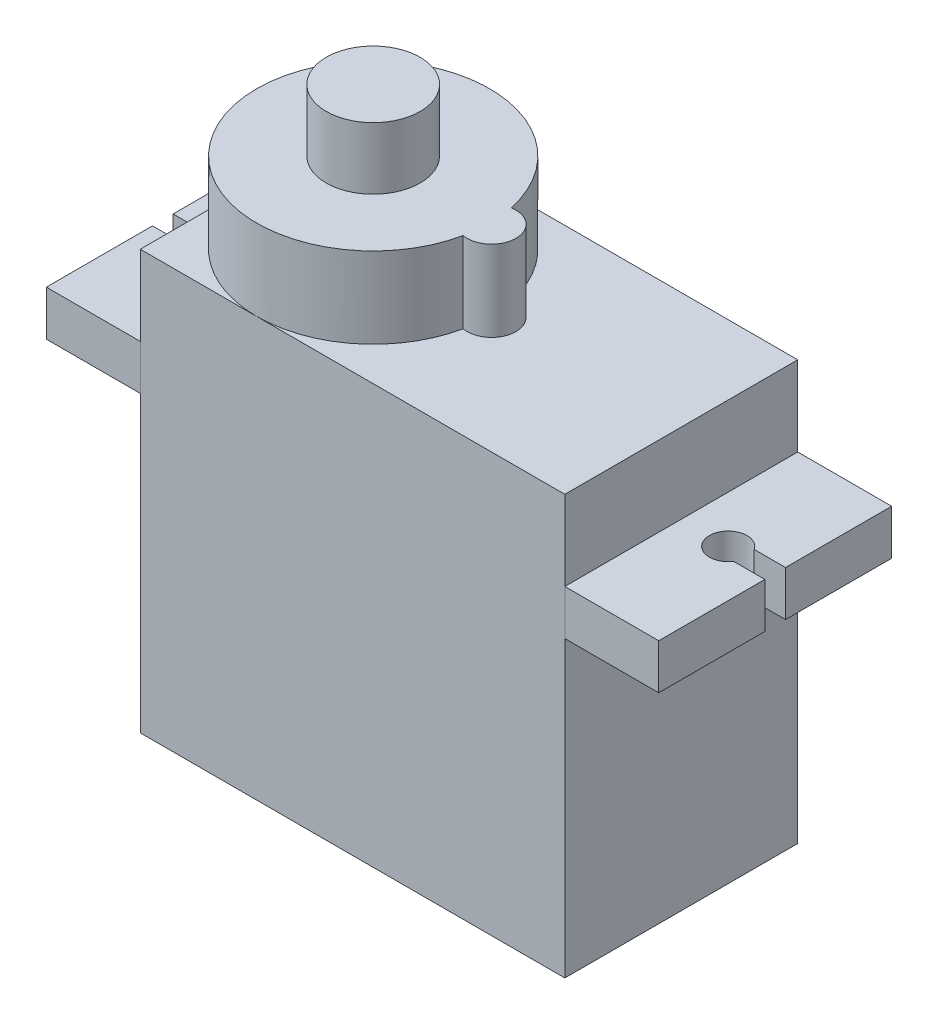
ISO-10303-21;
HEADER;
FILE_DESCRIPTION(('STEP AP214'),'2;1');
FILE_NAME('part.step','',(''),(''),'','','');
FILE_SCHEMA(('AUTOMOTIVE_DESIGN { 1 0 10303 214 1 1 1 1 }'));
ENDSEC;
DATA;
#1=APPLICATION_CONTEXT('core data for automotive mechanical design processes');
#2=APPLICATION_PROTOCOL_DEFINITION('international standard','automotive_design',2000,#1);
#3=PRODUCT_CONTEXT('',#1,'mechanical');
#4=PRODUCT('Part','Part','',(#3));
#5=PRODUCT_RELATED_PRODUCT_CATEGORY('part','',(#4));
#6=PRODUCT_DEFINITION_FORMATION('','',#4);
#7=PRODUCT_DEFINITION_CONTEXT('part definition',#1,'design');
#8=PRODUCT_DEFINITION('design','',#6,#7);
#9=PRODUCT_DEFINITION_SHAPE('','',#8);
#10=(LENGTH_UNIT() NAMED_UNIT(*) SI_UNIT(.MILLI.,.METRE.));
#11=(NAMED_UNIT(*) PLANE_ANGLE_UNIT() SI_UNIT($,.RADIAN.));
#12=(NAMED_UNIT(*) SI_UNIT($,.STERADIAN.) SOLID_ANGLE_UNIT());
#13=UNCERTAINTY_MEASURE_WITH_UNIT(LENGTH_MEASURE(1.E-05),#10,'distance_accuracy_value','');
#14=(GEOMETRIC_REPRESENTATION_CONTEXT(3) GLOBAL_UNCERTAINTY_ASSIGNED_CONTEXT((#13)) GLOBAL_UNIT_ASSIGNED_CONTEXT((#10,
#11,#12)) REPRESENTATION_CONTEXT('',''));
#15=CARTESIAN_POINT('',(0.,0.,0.));
#16=DIRECTION('',(0.,0.,1.));
#17=DIRECTION('',(1.,0.,0.));
#18=AXIS2_PLACEMENT_3D('',#15,#16,#17);
#19=CARTESIAN_POINT('',(-13.6,4.5,1.2));
#20=DIRECTION('',(1.,0.,0.));
#21=DIRECTION('',(0.,0.,-1.));
#22=AXIS2_PLACEMENT_3D('',#19,#20,#21);
#23=CYLINDRICAL_SURFACE('',#22,0.6);
#24=CARTESIAN_POINT('',(-13.6,4.5,1.2));
#25=DIRECTION('',(-1.,0.,0.));
#26=DIRECTION('',(0.,0.,1.));
#27=AXIS2_PLACEMENT_3D('',#24,#25,#26);
#28=CIRCLE('',#27,0.6);
#29=CARTESIAN_POINT('',(-13.6,4.5,1.8));
#30=VERTEX_POINT('',#29);
#31=EDGE_CURVE('E12',#30,#30,#28,.T.);
#32=ORIENTED_EDGE('',*,*,#31,.F.);
#33=EDGE_LOOP('',(#32));
#34=FACE_BOUND('',#33,.T.);
#35=CARTESIAN_POINT('',(-11.3,4.5,1.2));
#36=DIRECTION('',(-1.,0.,0.));
#37=DIRECTION('',(0.,0.,1.));
#38=AXIS2_PLACEMENT_3D('',#35,#36,#37);
#39=CIRCLE('',#38,0.6);
#40=CARTESIAN_POINT('',(-11.3,4.5,1.8));
#41=VERTEX_POINT('',#40);
#42=EDGE_CURVE('E52',#41,#41,#39,.T.);
#43=ORIENTED_EDGE('',*,*,#42,.T.);
#44=EDGE_LOOP('',(#43));
#45=FACE_BOUND('',#44,.T.);
#46=ADVANCED_FACE('F49',(#34,#45),#23,.T.);
#47=CARTESIAN_POINT('',(-13.6,0.,0.));
#48=DIRECTION('',(-1.,0.,0.));
#49=DIRECTION('',(0.,0.,1.));
#50=AXIS2_PLACEMENT_3D('',#47,#48,#49);
#51=PLANE('',#50);
#52=ORIENTED_EDGE('',*,*,#31,.T.);
#53=EDGE_LOOP('',(#52));
#54=FACE_BOUND('',#53,.T.);
#55=ADVANCED_FACE('F64',(#54),#51,.T.);
#56=CARTESIAN_POINT('',(-11.3,0.,0.));
#57=DIRECTION('',(-1.,0.,0.));
#58=DIRECTION('',(0.,0.,1.));
#59=AXIS2_PLACEMENT_3D('',#56,#57,#58);
#60=PLANE('',#59);
#61=ORIENTED_EDGE('',*,*,#42,.F.);
#62=EDGE_LOOP('',(#61));
#63=FACE_BOUND('',#62,.T.);
#64=ADVANCED_FACE('F62',(#63),#60,.F.);
#65=CLOSED_SHELL('',(#46,#55,#64));
#66=MANIFOLD_SOLID_BREP('B2',#65);
#67=CARTESIAN_POINT('',(-13.6,4.5,-1.2));
#68=DIRECTION('',(1.,0.,0.));
#69=DIRECTION('',(0.,0.,-1.));
#70=AXIS2_PLACEMENT_3D('',#67,#68,#69);
#71=CYLINDRICAL_SURFACE('',#70,0.6);
#72=CARTESIAN_POINT('',(-13.6,4.5,-1.2));
#73=DIRECTION('',(-1.,0.,0.));
#74=DIRECTION('',(0.,0.,1.));
#75=AXIS2_PLACEMENT_3D('',#72,#73,#74);
#76=CIRCLE('',#75,0.6);
#77=CARTESIAN_POINT('',(-13.6,4.5,-0.600000000000001));
#78=VERTEX_POINT('',#77);
#79=EDGE_CURVE('E48',#78,#78,#76,.T.);
#80=ORIENTED_EDGE('',*,*,#79,.F.);
#81=EDGE_LOOP('',(#80));
#82=FACE_BOUND('',#81,.T.);
#83=CARTESIAN_POINT('',(-11.3,4.5,-1.2));
#84=DIRECTION('',(-1.,0.,0.));
#85=DIRECTION('',(0.,0.,1.));
#86=AXIS2_PLACEMENT_3D('',#83,#84,#85);
#87=CIRCLE('',#86,0.6);
#88=CARTESIAN_POINT('',(-11.3,4.5,-0.600000000000001));
#89=VERTEX_POINT('',#88);
#90=EDGE_CURVE('E104',#89,#89,#87,.T.);
#91=ORIENTED_EDGE('',*,*,#90,.T.);
#92=EDGE_LOOP('',(#91));
#93=FACE_BOUND('',#92,.T.);
#94=ADVANCED_FACE('F101',(#82,#93),#71,.T.);
#95=CARTESIAN_POINT('',(-13.6,0.,0.));
#96=DIRECTION('',(-1.,0.,0.));
#97=DIRECTION('',(0.,0.,1.));
#98=AXIS2_PLACEMENT_3D('',#95,#96,#97);
#99=PLANE('',#98);
#100=ORIENTED_EDGE('',*,*,#79,.T.);
#101=EDGE_LOOP('',(#100));
#102=FACE_BOUND('',#101,.T.);
#103=ADVANCED_FACE('F116',(#102),#99,.T.);
#104=CARTESIAN_POINT('',(-11.3,0.,0.));
#105=DIRECTION('',(-1.,0.,0.));
#106=DIRECTION('',(0.,0.,1.));
#107=AXIS2_PLACEMENT_3D('',#104,#105,#106);
#108=PLANE('',#107);
#109=ORIENTED_EDGE('',*,*,#90,.F.);
#110=EDGE_LOOP('',(#109));
#111=FACE_BOUND('',#110,.T.);
#112=ADVANCED_FACE('F114',(#111),#108,.F.);
#113=CLOSED_SHELL('',(#94,#103,#112));
#114=MANIFOLD_SOLID_BREP('B7',#113);
#115=CARTESIAN_POINT('',(-13.6,4.5,0.));
#116=DIRECTION('',(1.,0.,0.));
#117=DIRECTION('',(0.,0.,-1.));
#118=AXIS2_PLACEMENT_3D('',#115,#116,#117);
#119=CYLINDRICAL_SURFACE('',#118,0.6);
#120=CARTESIAN_POINT('',(-13.6,4.5,0.));
#121=DIRECTION('',(-1.,0.,0.));
#122=DIRECTION('',(0.,0.,1.));
#123=AXIS2_PLACEMENT_3D('',#120,#121,#122);
#124=CIRCLE('',#123,0.6);
#125=CARTESIAN_POINT('',(-13.6,4.5,0.599999999999999));
#126=VERTEX_POINT('',#125);
#127=EDGE_CURVE('E100',#126,#126,#124,.T.);
#128=ORIENTED_EDGE('',*,*,#127,.F.);
#129=EDGE_LOOP('',(#128));
#130=FACE_BOUND('',#129,.T.);
#131=CARTESIAN_POINT('',(-11.3,4.5,0.));
#132=DIRECTION('',(-1.,0.,0.));
#133=DIRECTION('',(0.,0.,1.));
#134=AXIS2_PLACEMENT_3D('',#131,#132,#133);
#135=CIRCLE('',#134,0.6);
#136=CARTESIAN_POINT('',(-11.3,4.5,0.599999999999999));
#137=VERTEX_POINT('',#136);
#138=EDGE_CURVE('E158',#137,#137,#135,.T.);
#139=ORIENTED_EDGE('',*,*,#138,.T.);
#140=EDGE_LOOP('',(#139));
#141=FACE_BOUND('',#140,.T.);
#142=ADVANCED_FACE('F155',(#130,#141),#119,.T.);
#143=CARTESIAN_POINT('',(-13.6,0.,0.));
#144=DIRECTION('',(-1.,0.,0.));
#145=DIRECTION('',(0.,0.,1.));
#146=AXIS2_PLACEMENT_3D('',#143,#144,#145);
#147=PLANE('',#146);
#148=ORIENTED_EDGE('',*,*,#127,.T.);
#149=EDGE_LOOP('',(#148));
#150=FACE_BOUND('',#149,.T.);
#151=ADVANCED_FACE('F170',(#150),#147,.T.);
#152=CARTESIAN_POINT('',(-11.3,0.,0.));
#153=DIRECTION('',(-1.,0.,0.));
#154=DIRECTION('',(0.,0.,1.));
#155=AXIS2_PLACEMENT_3D('',#152,#153,#154);
#156=PLANE('',#155);
#157=ORIENTED_EDGE('',*,*,#138,.F.);
#158=EDGE_LOOP('',(#157));
#159=FACE_BOUND('',#158,.T.);
#160=ADVANCED_FACE('F168',(#159),#156,.F.);
#161=CLOSED_SHELL('',(#142,#151,#160));
#162=MANIFOLD_SOLID_BREP('B43',#161);
#163=CARTESIAN_POINT('',(-16.3,0.,0.));
#164=DIRECTION('',(-1.,0.,0.));
#165=DIRECTION('',(0.,0.,1.));
#166=AXIS2_PLACEMENT_3D('',#163,#164,#165);
#167=PLANE('',#166);
#168=DIRECTION('',(0.,1.,0.));
#169=VECTOR('',#168,1.);
#170=CARTESIAN_POINT('',(-16.3,-0.001000000000001,-0.55));
#171=LINE('',#170,#169);
#172=CARTESIAN_POINT('',(-16.3,15.65,-0.55));
#173=VERTEX_POINT('',#172);
#174=CARTESIAN_POINT('',(-16.3,18.05,-0.55));
#175=VERTEX_POINT('',#174);
#176=EDGE_CURVE('E339',#173,#175,#171,.T.);
#177=ORIENTED_EDGE('',*,*,#176,.T.);
#178=DIRECTION('',(0.,0.,-1.));
#179=VECTOR('',#178,1.);
#180=CARTESIAN_POINT('',(-16.3,18.05,6.2));
#181=LINE('',#180,#179);
#182=CARTESIAN_POINT('',(-16.3,18.05,-6.2));
#183=VERTEX_POINT('',#182);
#184=EDGE_CURVE('E262',#175,#183,#181,.T.);
#185=ORIENTED_EDGE('',*,*,#184,.T.);
#186=DIRECTION('',(0.,-1.,0.));
#187=VECTOR('',#186,1.);
#188=CARTESIAN_POINT('',(-16.3,18.05,-6.2));
#189=LINE('',#188,#187);
#190=CARTESIAN_POINT('',(-16.3,15.65,-6.2));
#191=VERTEX_POINT('',#190);
#192=EDGE_CURVE('E301',#183,#191,#189,.T.);
#193=ORIENTED_EDGE('',*,*,#192,.T.);
#194=DIRECTION('',(0.,0.,1.));
#195=VECTOR('',#194,1.);
#196=CARTESIAN_POINT('',(-16.3,15.65,-6.2));
#197=LINE('',#196,#195);
#198=EDGE_CURVE('E307',#191,#173,#197,.T.);
#199=ORIENTED_EDGE('',*,*,#198,.T.);
#200=EDGE_LOOP('',(#177,#185,#193,#199));
#201=FACE_BOUND('',#200,.T.);
#202=ADVANCED_FACE('F209',(#201),#167,.T.);
#203=CARTESIAN_POINT('',(-16.3,18.05,6.2));
#204=DIRECTION('',(0.,-1.,0.));
#205=DIRECTION('',(0.,0.,-1.));
#206=AXIS2_PLACEMENT_3D('',#203,#204,#205);
#207=PLANE('',#206);
#208=ORIENTED_EDGE('',*,*,#184,.F.);
#209=DIRECTION('',(-1.,0.,0.));
#210=VECTOR('',#209,1.);
#211=CARTESIAN_POINT('',(-16.3,18.05,-0.55));
#212=LINE('',#211,#210);
#213=CARTESIAN_POINT('',(-14.6351646544245,18.05,-0.55));
#214=VERTEX_POINT('',#213);
#215=EDGE_CURVE('E290',#214,#175,#212,.T.);
#216=ORIENTED_EDGE('',*,*,#215,.F.);
#217=CARTESIAN_POINT('',(-13.8,18.05,0.));
#218=DIRECTION('',(0.,1.,0.));
#219=DIRECTION('',(0.,0.,1.));
#220=AXIS2_PLACEMENT_3D('',#217,#218,#219);
#221=CIRCLE('',#220,1.);
#222=CARTESIAN_POINT('',(-14.6351646544245,18.05,0.55));
#223=VERTEX_POINT('',#222);
#224=EDGE_CURVE('E297',#223,#214,#221,.T.);
#225=ORIENTED_EDGE('',*,*,#224,.F.);
#226=DIRECTION('',(1.,0.,0.));
#227=VECTOR('',#226,1.);
#228=CARTESIAN_POINT('',(-16.3,18.05,0.55));
#229=LINE('',#228,#227);
#230=CARTESIAN_POINT('',(-16.3,18.05,0.55));
#231=VERTEX_POINT('',#230);
#232=EDGE_CURVE('E286',#231,#223,#229,.T.);
#233=ORIENTED_EDGE('',*,*,#232,.F.);
#234=CARTESIAN_POINT('',(-16.3,18.05,6.2));
#235=VERTEX_POINT('',#234);
#236=EDGE_CURVE('E294',#235,#231,#181,.T.);
#237=ORIENTED_EDGE('',*,*,#236,.F.);
#238=DIRECTION('',(1.,0.,0.));
#239=VECTOR('',#238,1.);
#240=CARTESIAN_POINT('',(-16.3,18.05,6.2));
#241=LINE('',#240,#239);
#242=CARTESIAN_POINT('',(-11.3,18.05,6.2));
#243=VERTEX_POINT('',#242);
#244=EDGE_CURVE('E311',#235,#243,#241,.T.);
#245=ORIENTED_EDGE('',*,*,#244,.T.);
#246=DIRECTION('',(0.,0.,-1.));
#247=VECTOR('',#246,1.);
#248=CARTESIAN_POINT('',(-11.3,18.05,6.2));
#249=LINE('',#248,#247);
#250=CARTESIAN_POINT('',(-11.3,18.05,-6.2));
#251=VERTEX_POINT('',#250);
#252=EDGE_CURVE('E312',#243,#251,#249,.T.);
#253=ORIENTED_EDGE('',*,*,#252,.T.);
#254=DIRECTION('',(1.,0.,0.));
#255=VECTOR('',#254,1.);
#256=CARTESIAN_POINT('',(-16.3,18.05,-6.2));
#257=LINE('',#256,#255);
#258=EDGE_CURVE('E153',#183,#251,#257,.T.);
#259=ORIENTED_EDGE('',*,*,#258,.F.);
#260=EDGE_LOOP('',(#208,#216,#225,#233,#237,#245,#253,#259));
#261=FACE_BOUND('',#260,.T.);
#262=ADVANCED_FACE('F211',(#261),#207,.F.);
#263=CARTESIAN_POINT('',(-16.3,18.05,-6.2));
#264=DIRECTION('',(0.,0.,1.));
#265=DIRECTION('',(1.,0.,0.));
#266=AXIS2_PLACEMENT_3D('',#263,#264,#265);
#267=PLANE('',#266);
#268=DIRECTION('',(0.,-1.,0.));
#269=VECTOR('',#268,1.);
#270=CARTESIAN_POINT('',(-11.3,18.05,-6.2));
#271=LINE('',#270,#269);
#272=CARTESIAN_POINT('',(-11.3,15.65,-6.2));
#273=VERTEX_POINT('',#272);
#274=EDGE_CURVE('E315',#251,#273,#271,.T.);
#275=ORIENTED_EDGE('',*,*,#274,.T.);
#276=DIRECTION('',(1.,0.,0.));
#277=VECTOR('',#276,1.);
#278=CARTESIAN_POINT('',(-16.3,15.65,-6.2));
#279=LINE('',#278,#277);
#280=EDGE_CURVE('E217',#191,#273,#279,.T.);
#281=ORIENTED_EDGE('',*,*,#280,.F.);
#282=ORIENTED_EDGE('',*,*,#192,.F.);
#283=ORIENTED_EDGE('',*,*,#258,.T.);
#284=EDGE_LOOP('',(#275,#281,#282,#283));
#285=FACE_BOUND('',#284,.T.);
#286=ADVANCED_FACE('F353',(#285),#267,.F.);
#287=CARTESIAN_POINT('',(-16.3,15.65,-6.2));
#288=DIRECTION('',(0.,1.,0.));
#289=DIRECTION('',(0.,0.,1.));
#290=AXIS2_PLACEMENT_3D('',#287,#288,#289);
#291=PLANE('',#290);
#292=CARTESIAN_POINT('',(-13.8,15.65,0.));
#293=DIRECTION('',(0.,1.,0.));
#294=DIRECTION('',(0.,0.,1.));
#295=AXIS2_PLACEMENT_3D('',#292,#293,#294);
#296=CIRCLE('',#295,1.);
#297=CARTESIAN_POINT('',(-14.6351646544245,15.65,-0.55));
#298=VERTEX_POINT('',#297);
#299=CARTESIAN_POINT('',(-14.6351646544245,15.65,0.55));
#300=VERTEX_POINT('',#299);
#301=EDGE_CURVE('E338',#298,#300,#296,.F.);
#302=ORIENTED_EDGE('',*,*,#301,.F.);
#303=DIRECTION('',(1.,0.,0.));
#304=VECTOR('',#303,1.);
#305=CARTESIAN_POINT('',(-16.3,15.65,-0.55));
#306=LINE('',#305,#304);
#307=EDGE_CURVE('E298',#173,#298,#306,.T.);
#308=ORIENTED_EDGE('',*,*,#307,.F.);
#309=ORIENTED_EDGE('',*,*,#198,.F.);
#310=ORIENTED_EDGE('',*,*,#280,.T.);
#311=DIRECTION('',(0.,0.,1.));
#312=VECTOR('',#311,1.);
#313=CARTESIAN_POINT('',(-11.3,15.65,-6.2));
#314=LINE('',#313,#312);
#315=CARTESIAN_POINT('',(-11.3,15.65,6.2));
#316=VERTEX_POINT('',#315);
#317=EDGE_CURVE('E317',#273,#316,#314,.T.);
#318=ORIENTED_EDGE('',*,*,#317,.T.);
#319=DIRECTION('',(1.,0.,0.));
#320=VECTOR('',#319,1.);
#321=CARTESIAN_POINT('',(-16.3,15.65,6.2));
#322=LINE('',#321,#320);
#323=CARTESIAN_POINT('',(-16.3,15.65,6.2));
#324=VERTEX_POINT('',#323);
#325=EDGE_CURVE('E321',#324,#316,#322,.T.);
#326=ORIENTED_EDGE('',*,*,#325,.F.);
#327=CARTESIAN_POINT('',(-16.3,15.65,0.549999999999997));
#328=VERTEX_POINT('',#327);
#329=EDGE_CURVE('E303',#328,#324,#197,.T.);
#330=ORIENTED_EDGE('',*,*,#329,.F.);
#331=DIRECTION('',(-1.,0.,0.));
#332=VECTOR('',#331,1.);
#333=CARTESIAN_POINT('',(-16.3,15.65,0.55));
#334=LINE('',#333,#332);
#335=EDGE_CURVE('E224',#300,#328,#334,.T.);
#336=ORIENTED_EDGE('',*,*,#335,.F.);
#337=EDGE_LOOP('',(#302,#308,#309,#310,#318,#326,#330,#336));
#338=FACE_BOUND('',#337,.T.);
#339=ADVANCED_FACE('F328',(#338),#291,.F.);
#340=CARTESIAN_POINT('',(-16.3,15.65,6.2));
#341=DIRECTION('',(0.,0.,-1.));
#342=DIRECTION('',(-1.,0.,0.));
#343=AXIS2_PLACEMENT_3D('',#340,#341,#342);
#344=PLANE('',#343);
#345=DIRECTION('',(0.,1.,0.));
#346=VECTOR('',#345,1.);
#347=CARTESIAN_POINT('',(-11.3,15.65,6.2));
#348=LINE('',#347,#346);
#349=EDGE_CURVE('E254',#316,#243,#348,.T.);
#350=ORIENTED_EDGE('',*,*,#349,.T.);
#351=ORIENTED_EDGE('',*,*,#244,.F.);
#352=DIRECTION('',(0.,1.,0.));
#353=VECTOR('',#352,1.);
#354=CARTESIAN_POINT('',(-16.3,15.65,6.2));
#355=LINE('',#354,#353);
#356=EDGE_CURVE('E233',#324,#235,#355,.T.);
#357=ORIENTED_EDGE('',*,*,#356,.F.);
#358=ORIENTED_EDGE('',*,*,#325,.T.);
#359=EDGE_LOOP('',(#350,#351,#357,#358));
#360=FACE_BOUND('',#359,.T.);
#361=ADVANCED_FACE('F336',(#360),#344,.F.);
#362=DIRECTION('',(0.,1.,0.));
#363=VECTOR('',#362,1.);
#364=CARTESIAN_POINT('',(-16.3,-0.001000000000001,0.55));
#365=LINE('',#364,#363);
#366=EDGE_CURVE('E283',#328,#231,#365,.T.);
#367=ORIENTED_EDGE('',*,*,#366,.F.);
#368=ORIENTED_EDGE('',*,*,#329,.T.);
#369=ORIENTED_EDGE('',*,*,#356,.T.);
#370=ORIENTED_EDGE('',*,*,#236,.T.);
#371=EDGE_LOOP('',(#367,#368,#369,#370));
#372=FACE_BOUND('',#371,.T.);
#373=ADVANCED_FACE('F300',(#372),#167,.T.);
#374=CARTESIAN_POINT('',(-11.3,0.,0.));
#375=DIRECTION('',(-1.,0.,0.));
#376=DIRECTION('',(0.,0.,1.));
#377=AXIS2_PLACEMENT_3D('',#374,#375,#376);
#378=PLANE('',#377);
#379=ORIENTED_EDGE('',*,*,#252,.F.);
#380=ORIENTED_EDGE('',*,*,#349,.F.);
#381=ORIENTED_EDGE('',*,*,#317,.F.);
#382=ORIENTED_EDGE('',*,*,#274,.F.);
#383=EDGE_LOOP('',(#379,#380,#381,#382));
#384=FACE_BOUND('',#383,.T.);
#385=ADVANCED_FACE('F334',(#384),#378,.F.);
#386=CARTESIAN_POINT('',(-16.3,-0.001000000000001,-0.55));
#387=DIRECTION('',(0.,0.,-1.));
#388=DIRECTION('',(-1.,0.,0.));
#389=AXIS2_PLACEMENT_3D('',#386,#387,#388);
#390=PLANE('',#389);
#391=ORIENTED_EDGE('',*,*,#307,.T.);
#392=DIRECTION('',(0.,1.,0.));
#393=VECTOR('',#392,1.);
#394=CARTESIAN_POINT('',(-14.6351646544245,-0.001000000000001,-0.55));
#395=LINE('',#394,#393);
#396=EDGE_CURVE('E340',#298,#214,#395,.T.);
#397=ORIENTED_EDGE('',*,*,#396,.T.);
#398=ORIENTED_EDGE('',*,*,#215,.T.);
#399=ORIENTED_EDGE('',*,*,#176,.F.);
#400=EDGE_LOOP('',(#391,#397,#398,#399));
#401=FACE_BOUND('',#400,.T.);
#402=ADVANCED_FACE('F352',(#401),#390,.F.);
#403=CARTESIAN_POINT('',(-13.8,-0.001000000000001,0.));
#404=DIRECTION('',(0.,1.,0.));
#405=DIRECTION('',(0.,0.,1.));
#406=AXIS2_PLACEMENT_3D('',#403,#404,#405);
#407=CYLINDRICAL_SURFACE('',#406,1.);
#408=ORIENTED_EDGE('',*,*,#301,.T.);
#409=DIRECTION('',(0.,1.,0.));
#410=VECTOR('',#409,1.);
#411=CARTESIAN_POINT('',(-14.6351646544245,-0.001000000000001,0.55));
#412=LINE('',#411,#410);
#413=EDGE_CURVE('E289',#300,#223,#412,.T.);
#414=ORIENTED_EDGE('',*,*,#413,.T.);
#415=ORIENTED_EDGE('',*,*,#224,.T.);
#416=ORIENTED_EDGE('',*,*,#396,.F.);
#417=EDGE_LOOP('',(#408,#414,#415,#416));
#418=FACE_BOUND('',#417,.T.);
#419=ADVANCED_FACE('F347',(#418),#407,.F.);
#420=CARTESIAN_POINT('',(-16.3,-0.001000000000001,0.55));
#421=DIRECTION('',(0.,0.,1.));
#422=DIRECTION('',(1.,0.,0.));
#423=AXIS2_PLACEMENT_3D('',#420,#421,#422);
#424=PLANE('',#423);
#425=ORIENTED_EDGE('',*,*,#335,.T.);
#426=ORIENTED_EDGE('',*,*,#366,.T.);
#427=ORIENTED_EDGE('',*,*,#232,.T.);
#428=ORIENTED_EDGE('',*,*,#413,.F.);
#429=EDGE_LOOP('',(#425,#426,#427,#428));
#430=FACE_BOUND('',#429,.T.);
#431=ADVANCED_FACE('F285',(#430),#424,.F.);
#432=CLOSED_SHELL('',(#202,#262,#286,#339,#361,#373,#385,#402,#419,#431));
#433=MANIFOLD_SOLID_BREP('B95',#432);
#434=CARTESIAN_POINT('',(16.3,15.65,6.2));
#435=DIRECTION('',(0.,1.,0.));
#436=DIRECTION('',(0.,0.,1.));
#437=AXIS2_PLACEMENT_3D('',#434,#435,#436);
#438=PLANE('',#437);
#439=DIRECTION('',(-1.,0.,0.));
#440=VECTOR('',#439,1.);
#441=CARTESIAN_POINT('',(14.6351646544245,15.65,-0.55));
#442=LINE('',#441,#440);
#443=CARTESIAN_POINT('',(16.3,15.65,-0.55));
#444=VERTEX_POINT('',#443);
#445=CARTESIAN_POINT('',(14.6351646544245,15.65,-0.55));
#446=VERTEX_POINT('',#445);
#447=EDGE_CURVE('E534',#444,#446,#442,.T.);
#448=ORIENTED_EDGE('',*,*,#447,.T.);
#449=CARTESIAN_POINT('',(13.8,15.65,0.));
#450=DIRECTION('',(0.,1.,0.));
#451=DIRECTION('',(0.,0.,1.));
#452=AXIS2_PLACEMENT_3D('',#449,#450,#451);
#453=CIRCLE('',#452,1.);
#454=CARTESIAN_POINT('',(14.6351646544245,15.65,0.55));
#455=VERTEX_POINT('',#454);
#456=EDGE_CURVE('E521',#455,#446,#453,.F.);
#457=ORIENTED_EDGE('',*,*,#456,.F.);
#458=DIRECTION('',(-1.,0.,0.));
#459=VECTOR('',#458,1.);
#460=CARTESIAN_POINT('',(14.6351646544245,15.65,0.55));
#461=LINE('',#460,#459);
#462=CARTESIAN_POINT('',(16.3,15.65,0.55));
#463=VERTEX_POINT('',#462);
#464=EDGE_CURVE('E528',#463,#455,#461,.T.);
#465=ORIENTED_EDGE('',*,*,#464,.F.);
#466=DIRECTION('',(0.,0.,-1.));
#467=VECTOR('',#466,1.);
#468=CARTESIAN_POINT('',(16.3,15.65,6.2));
#469=LINE('',#468,#467);
#470=CARTESIAN_POINT('',(16.3,15.65,6.2));
#471=VERTEX_POINT('',#470);
#472=EDGE_CURVE('E494',#471,#463,#469,.T.);
#473=ORIENTED_EDGE('',*,*,#472,.F.);
#474=DIRECTION('',(-1.,0.,0.));
#475=VECTOR('',#474,1.);
#476=CARTESIAN_POINT('',(16.3,15.65,6.2));
#477=LINE('',#476,#475);
#478=CARTESIAN_POINT('',(11.3,15.65,6.2));
#479=VERTEX_POINT('',#478);
#480=EDGE_CURVE('E207',#471,#479,#477,.T.);
#481=ORIENTED_EDGE('',*,*,#480,.T.);
#482=DIRECTION('',(0.,0.,-1.));
#483=VECTOR('',#482,1.);
#484=CARTESIAN_POINT('',(11.3,15.65,6.2));
#485=LINE('',#484,#483);
#486=CARTESIAN_POINT('',(11.3,15.65,-6.2));
#487=VERTEX_POINT('',#486);
#488=EDGE_CURVE('E558',#479,#487,#485,.T.);
#489=ORIENTED_EDGE('',*,*,#488,.T.);
#490=DIRECTION('',(-1.,0.,0.));
#491=VECTOR('',#490,1.);
#492=CARTESIAN_POINT('',(16.3,15.65,-6.2));
#493=LINE('',#492,#491);
#494=CARTESIAN_POINT('',(16.3,15.65,-6.2));
#495=VERTEX_POINT('',#494);
#496=EDGE_CURVE('E450',#495,#487,#493,.T.);
#497=ORIENTED_EDGE('',*,*,#496,.F.);
#498=EDGE_CURVE('E548',#444,#495,#469,.T.);
#499=ORIENTED_EDGE('',*,*,#498,.F.);
#500=EDGE_LOOP('',(#448,#457,#465,#473,#481,#489,#497,#499));
#501=FACE_BOUND('',#500,.T.);
#502=ADVANCED_FACE('F442',(#501),#438,.F.);
#503=CARTESIAN_POINT('',(16.3,18.05,6.2));
#504=DIRECTION('',(0.,-1.,0.));
#505=DIRECTION('',(0.,0.,-1.));
#506=AXIS2_PLACEMENT_3D('',#503,#504,#505);
#507=PLANE('',#506);
#508=DIRECTION('',(1.,0.,0.));
#509=VECTOR('',#508,1.);
#510=CARTESIAN_POINT('',(14.6351646544245,18.05,-0.55));
#511=LINE('',#510,#509);
#512=CARTESIAN_POINT('',(14.6351646544245,18.05,-0.55));
#513=VERTEX_POINT('',#512);
#514=CARTESIAN_POINT('',(16.3,18.05,-0.55));
#515=VERTEX_POINT('',#514);
#516=EDGE_CURVE('E526',#513,#515,#511,.T.);
#517=ORIENTED_EDGE('',*,*,#516,.T.);
#518=DIRECTION('',(0.,0.,1.));
#519=VECTOR('',#518,1.);
#520=CARTESIAN_POINT('',(16.3,18.05,6.2));
#521=LINE('',#520,#519);
#522=CARTESIAN_POINT('',(16.3,18.05,-6.2));
#523=VERTEX_POINT('',#522);
#524=EDGE_CURVE('E552',#523,#515,#521,.T.);
#525=ORIENTED_EDGE('',*,*,#524,.F.);
#526=DIRECTION('',(-1.,0.,0.));
#527=VECTOR('',#526,1.);
#528=CARTESIAN_POINT('',(16.3,18.05,-6.2));
#529=LINE('',#528,#527);
#530=CARTESIAN_POINT('',(11.3,18.05,-6.2));
#531=VERTEX_POINT('',#530);
#532=EDGE_CURVE('E564',#523,#531,#529,.T.);
#533=ORIENTED_EDGE('',*,*,#532,.T.);
#534=DIRECTION('',(0.,0.,1.));
#535=VECTOR('',#534,1.);
#536=CARTESIAN_POINT('',(11.3,18.05,6.2));
#537=LINE('',#536,#535);
#538=CARTESIAN_POINT('',(11.3,18.05,6.2));
#539=VERTEX_POINT('',#538);
#540=EDGE_CURVE('E487',#531,#539,#537,.T.);
#541=ORIENTED_EDGE('',*,*,#540,.T.);
#542=DIRECTION('',(-1.,0.,0.));
#543=VECTOR('',#542,1.);
#544=CARTESIAN_POINT('',(16.3,18.05,6.2));
#545=LINE('',#544,#543);
#546=CARTESIAN_POINT('',(16.3,18.05,6.2));
#547=VERTEX_POINT('',#546);
#548=EDGE_CURVE('E555',#547,#539,#545,.T.);
#549=ORIENTED_EDGE('',*,*,#548,.F.);
#550=CARTESIAN_POINT('',(16.3,18.05,0.550000000000002));
#551=VERTEX_POINT('',#550);
#552=EDGE_CURVE('E465',#551,#547,#521,.T.);
#553=ORIENTED_EDGE('',*,*,#552,.F.);
#554=DIRECTION('',(1.,0.,0.));
#555=VECTOR('',#554,1.);
#556=CARTESIAN_POINT('',(14.6351646544245,18.05,0.55));
#557=LINE('',#556,#555);
#558=CARTESIAN_POINT('',(14.6351646544245,18.05,0.55));
#559=VERTEX_POINT('',#558);
#560=EDGE_CURVE('E457',#559,#551,#557,.T.);
#561=ORIENTED_EDGE('',*,*,#560,.F.);
#562=CARTESIAN_POINT('',(13.8,18.05,0.));
#563=DIRECTION('',(0.,1.,0.));
#564=DIRECTION('',(0.,0.,1.));
#565=AXIS2_PLACEMENT_3D('',#562,#563,#564);
#566=CIRCLE('',#565,1.);
#567=EDGE_CURVE('E524',#513,#559,#566,.T.);
#568=ORIENTED_EDGE('',*,*,#567,.F.);
#569=EDGE_LOOP('',(#517,#525,#533,#541,#549,#553,#561,#568));
#570=FACE_BOUND('',#569,.T.);
#571=ADVANCED_FACE('F578',(#570),#507,.F.);
#572=CARTESIAN_POINT('',(16.3,0.,0.));
#573=DIRECTION('',(1.,0.,0.));
#574=DIRECTION('',(0.,0.,-1.));
#575=AXIS2_PLACEMENT_3D('',#572,#573,#574);
#576=PLANE('',#575);
#577=ORIENTED_EDGE('',*,*,#524,.T.);
#578=DIRECTION('',(0.,1.,0.));
#579=VECTOR('',#578,1.);
#580=CARTESIAN_POINT('',(16.3,-0.001000000000001,-0.55));
#581=LINE('',#580,#579);
#582=EDGE_CURVE('E543',#444,#515,#581,.T.);
#583=ORIENTED_EDGE('',*,*,#582,.F.);
#584=ORIENTED_EDGE('',*,*,#498,.T.);
#585=DIRECTION('',(0.,1.,0.));
#586=VECTOR('',#585,1.);
#587=CARTESIAN_POINT('',(16.3,18.05,-6.2));
#588=LINE('',#587,#586);
#589=EDGE_CURVE('E550',#495,#523,#588,.T.);
#590=ORIENTED_EDGE('',*,*,#589,.T.);
#591=EDGE_LOOP('',(#577,#583,#584,#590));
#592=FACE_BOUND('',#591,.T.);
#593=ADVANCED_FACE('F584',(#592),#576,.T.);
#594=CARTESIAN_POINT('',(16.3,18.05,6.2));
#595=DIRECTION('',(0.,0.,-1.));
#596=DIRECTION('',(-1.,0.,0.));
#597=AXIS2_PLACEMENT_3D('',#594,#595,#596);
#598=PLANE('',#597);
#599=DIRECTION('',(0.,-1.,0.));
#600=VECTOR('',#599,1.);
#601=CARTESIAN_POINT('',(11.3,18.05,6.2));
#602=LINE('',#601,#600);
#603=EDGE_CURVE('E530',#539,#479,#602,.T.);
#604=ORIENTED_EDGE('',*,*,#603,.T.);
#605=ORIENTED_EDGE('',*,*,#480,.F.);
#606=DIRECTION('',(0.,-1.,0.));
#607=VECTOR('',#606,1.);
#608=CARTESIAN_POINT('',(16.3,18.05,6.2));
#609=LINE('',#608,#607);
#610=EDGE_CURVE('E546',#547,#471,#609,.T.);
#611=ORIENTED_EDGE('',*,*,#610,.F.);
#612=ORIENTED_EDGE('',*,*,#548,.T.);
#613=EDGE_LOOP('',(#604,#605,#611,#612));
#614=FACE_BOUND('',#613,.T.);
#615=ADVANCED_FACE('F444',(#614),#598,.F.);
#616=CARTESIAN_POINT('',(16.3,18.05,-6.2));
#617=DIRECTION('',(0.,0.,1.));
#618=DIRECTION('',(1.,0.,0.));
#619=AXIS2_PLACEMENT_3D('',#616,#617,#618);
#620=PLANE('',#619);
#621=DIRECTION('',(0.,1.,0.));
#622=VECTOR('',#621,1.);
#623=CARTESIAN_POINT('',(11.3,18.05,-6.2));
#624=LINE('',#623,#622);
#625=EDGE_CURVE('E560',#487,#531,#624,.T.);
#626=ORIENTED_EDGE('',*,*,#625,.T.);
#627=ORIENTED_EDGE('',*,*,#532,.F.);
#628=ORIENTED_EDGE('',*,*,#589,.F.);
#629=ORIENTED_EDGE('',*,*,#496,.T.);
#630=EDGE_LOOP('',(#626,#627,#628,#629));
#631=FACE_BOUND('',#630,.T.);
#632=ADVANCED_FACE('F570',(#631),#620,.F.);
#633=DIRECTION('',(0.,1.,0.));
#634=VECTOR('',#633,1.);
#635=CARTESIAN_POINT('',(16.3,-0.001000000000001,0.55));
#636=LINE('',#635,#634);
#637=EDGE_CURVE('E525',#463,#551,#636,.T.);
#638=ORIENTED_EDGE('',*,*,#637,.T.);
#639=ORIENTED_EDGE('',*,*,#552,.T.);
#640=ORIENTED_EDGE('',*,*,#610,.T.);
#641=ORIENTED_EDGE('',*,*,#472,.T.);
#642=EDGE_LOOP('',(#638,#639,#640,#641));
#643=FACE_BOUND('',#642,.T.);
#644=ADVANCED_FACE('F601',(#643),#576,.T.);
#645=CARTESIAN_POINT('',(11.3,0.,0.));
#646=DIRECTION('',(1.,0.,0.));
#647=DIRECTION('',(0.,0.,-1.));
#648=AXIS2_PLACEMENT_3D('',#645,#646,#647);
#649=PLANE('',#648);
#650=ORIENTED_EDGE('',*,*,#603,.F.);
#651=ORIENTED_EDGE('',*,*,#540,.F.);
#652=ORIENTED_EDGE('',*,*,#625,.F.);
#653=ORIENTED_EDGE('',*,*,#488,.F.);
#654=EDGE_LOOP('',(#650,#651,#652,#653));
#655=FACE_BOUND('',#654,.T.);
#656=ADVANCED_FACE('F574',(#655),#649,.F.);
#657=CARTESIAN_POINT('',(13.8,-0.001000000000001,0.));
#658=DIRECTION('',(0.,1.,0.));
#659=DIRECTION('',(0.,0.,1.));
#660=AXIS2_PLACEMENT_3D('',#657,#658,#659);
#661=CYLINDRICAL_SURFACE('',#660,1.);
#662=ORIENTED_EDGE('',*,*,#456,.T.);
#663=DIRECTION('',(0.,1.,0.));
#664=VECTOR('',#663,1.);
#665=CARTESIAN_POINT('',(14.6351646544245,-0.001000000000001,-0.55));
#666=LINE('',#665,#664);
#667=EDGE_CURVE('E531',#446,#513,#666,.T.);
#668=ORIENTED_EDGE('',*,*,#667,.T.);
#669=ORIENTED_EDGE('',*,*,#567,.T.);
#670=DIRECTION('',(0.,1.,0.));
#671=VECTOR('',#670,1.);
#672=CARTESIAN_POINT('',(14.6351646544245,-0.001000000000001,0.55));
#673=LINE('',#672,#671);
#674=EDGE_CURVE('E517',#455,#559,#673,.T.);
#675=ORIENTED_EDGE('',*,*,#674,.F.);
#676=EDGE_LOOP('',(#662,#668,#669,#675));
#677=FACE_BOUND('',#676,.T.);
#678=ADVANCED_FACE('F519',(#677),#661,.F.);
#679=CARTESIAN_POINT('',(14.6351646544245,-0.001000000000001,-0.55));
#680=DIRECTION('',(0.,0.,1.));
#681=DIRECTION('',(1.,0.,0.));
#682=AXIS2_PLACEMENT_3D('',#679,#680,#681);
#683=PLANE('',#682);
#684=ORIENTED_EDGE('',*,*,#582,.T.);
#685=ORIENTED_EDGE('',*,*,#516,.F.);
#686=ORIENTED_EDGE('',*,*,#667,.F.);
#687=ORIENTED_EDGE('',*,*,#447,.F.);
#688=EDGE_LOOP('',(#684,#685,#686,#687));
#689=FACE_BOUND('',#688,.T.);
#690=ADVANCED_FACE('F585',(#689),#683,.T.);
#691=CARTESIAN_POINT('',(14.6351646544245,-0.001000000000001,0.55));
#692=DIRECTION('',(0.,0.,1.));
#693=DIRECTION('',(1.,0.,0.));
#694=AXIS2_PLACEMENT_3D('',#691,#692,#693);
#695=PLANE('',#694);
#696=ORIENTED_EDGE('',*,*,#464,.T.);
#697=ORIENTED_EDGE('',*,*,#674,.T.);
#698=ORIENTED_EDGE('',*,*,#560,.T.);
#699=ORIENTED_EDGE('',*,*,#637,.F.);
#700=EDGE_LOOP('',(#696,#697,#698,#699));
#701=FACE_BOUND('',#700,.T.);
#702=ADVANCED_FACE('F529',(#701),#695,.F.);
#703=CLOSED_SHELL('',(#502,#571,#593,#615,#632,#644,#656,#678,#690,#702));
#704=MANIFOLD_SOLID_BREP('B147',#703);
#705=CARTESIAN_POINT('',(0.,22.3,0.));
#706=DIRECTION('',(0.,-1.,0.));
#707=DIRECTION('',(0.,0.,-1.));
#708=AXIS2_PLACEMENT_3D('',#705,#706,#707);
#709=PLANE('',#708);
#710=CARTESIAN_POINT('',(1.2,22.3,0.));
#711=DIRECTION('',(0.,1.,0.));
#712=DIRECTION('',(0.,0.,1.));
#713=AXIS2_PLACEMENT_3D('',#710,#711,#712);
#714=CIRCLE('',#713,1.3);
#715=CARTESIAN_POINT('',(0.966666666666667,22.3,1.27888840621673));
#716=VERTEX_POINT('',#715);
#717=CARTESIAN_POINT('',(0.966666666666667,22.3,-1.27888840621673));
#718=VERTEX_POINT('',#717);
#719=EDGE_CURVE('E745',#716,#718,#714,.T.);
#720=ORIENTED_EDGE('',*,*,#719,.F.);
#721=CARTESIAN_POINT('',(-5.1,22.3,0.));
#722=DIRECTION('',(0.,1.,0.));
#723=DIRECTION('',(0.,0.,1.));
#724=AXIS2_PLACEMENT_3D('',#721,#722,#723);
#725=CIRCLE('',#724,6.2);
#726=CARTESIAN_POINT('',(-5.1,22.3,6.2));
#727=VERTEX_POINT('',#726);
#728=EDGE_CURVE('E689',#727,#716,#725,.T.);
#729=ORIENTED_EDGE('',*,*,#728,.F.);
#730=DIRECTION('',(1.,0.,0.));
#731=VECTOR('',#730,1.);
#732=CARTESIAN_POINT('',(-11.3,22.3,6.2));
#733=LINE('',#732,#731);
#734=CARTESIAN_POINT('',(11.3,22.3,6.2));
#735=VERTEX_POINT('',#734);
#736=EDGE_CURVE('E765',#727,#735,#733,.T.);
#737=ORIENTED_EDGE('',*,*,#736,.T.);
#738=DIRECTION('',(0.,0.,-1.));
#739=VECTOR('',#738,1.);
#740=CARTESIAN_POINT('',(11.3,22.3,6.2));
#741=LINE('',#740,#739);
#742=CARTESIAN_POINT('',(11.3,22.3,-6.2));
#743=VERTEX_POINT('',#742);
#744=EDGE_CURVE('E754',#735,#743,#741,.T.);
#745=ORIENTED_EDGE('',*,*,#744,.T.);
#746=DIRECTION('',(-1.,0.,0.));
#747=VECTOR('',#746,1.);
#748=CARTESIAN_POINT('',(-11.3,22.3,-6.2));
#749=LINE('',#748,#747);
#750=CARTESIAN_POINT('',(-5.1,22.3,-6.2));
#751=VERTEX_POINT('',#750);
#752=EDGE_CURVE('E759',#743,#751,#749,.T.);
#753=ORIENTED_EDGE('',*,*,#752,.T.);
#754=EDGE_CURVE('E683',#718,#751,#725,.T.);
#755=ORIENTED_EDGE('',*,*,#754,.F.);
#756=EDGE_LOOP('',(#720,#729,#737,#745,#753,#755));
#757=FACE_BOUND('',#756,.T.);
#758=ADVANCED_FACE('F666',(#757),#709,.F.);
#759=CARTESIAN_POINT('',(-11.3,22.3,0.));
#760=VERTEX_POINT('',#759);
#761=EDGE_CURVE('E675',#751,#760,#725,.T.);
#762=ORIENTED_EDGE('',*,*,#761,.F.);
#763=CARTESIAN_POINT('',(-11.3,22.3,-6.2));
#764=VERTEX_POINT('',#763);
#765=EDGE_CURVE('E757',#751,#764,#749,.T.);
#766=ORIENTED_EDGE('',*,*,#765,.T.);
#767=DIRECTION('',(0.,0.,1.));
#768=VECTOR('',#767,1.);
#769=CARTESIAN_POINT('',(-11.3,22.3,6.2));
#770=LINE('',#769,#768);
#771=EDGE_CURVE('E762',#764,#760,#770,.T.);
#772=ORIENTED_EDGE('',*,*,#771,.T.);
#773=EDGE_LOOP('',(#762,#766,#772));
#774=FACE_BOUND('',#773,.T.);
#775=ADVANCED_FACE('F794',(#774),#709,.F.);
#776=CARTESIAN_POINT('',(11.3,22.3,6.2));
#777=DIRECTION('',(-1.,0.,0.));
#778=DIRECTION('',(0.,0.,1.));
#779=AXIS2_PLACEMENT_3D('',#776,#777,#778);
#780=PLANE('',#779);
#781=DIRECTION('',(0.,0.,-1.));
#782=VECTOR('',#781,1.);
#783=CARTESIAN_POINT('',(11.3,0.,6.2));
#784=LINE('',#783,#782);
#785=CARTESIAN_POINT('',(11.3,0.,6.2));
#786=VERTEX_POINT('',#785);
#787=CARTESIAN_POINT('',(11.3,0.,-6.2));
#788=VERTEX_POINT('',#787);
#789=EDGE_CURVE('E746',#786,#788,#784,.T.);
#790=ORIENTED_EDGE('',*,*,#789,.T.);
#791=DIRECTION('',(0.,-1.,0.));
#792=VECTOR('',#791,1.);
#793=CARTESIAN_POINT('',(11.3,22.3,-6.2));
#794=LINE('',#793,#792);
#795=EDGE_CURVE('E670',#743,#788,#794,.T.);
#796=ORIENTED_EDGE('',*,*,#795,.F.);
#797=ORIENTED_EDGE('',*,*,#744,.F.);
#798=DIRECTION('',(0.,-1.,0.));
#799=VECTOR('',#798,1.);
#800=CARTESIAN_POINT('',(11.3,22.3,6.2));
#801=LINE('',#800,#799);
#802=EDGE_CURVE('E768',#735,#786,#801,.T.);
#803=ORIENTED_EDGE('',*,*,#802,.T.);
#804=EDGE_LOOP('',(#790,#796,#797,#803));
#805=FACE_BOUND('',#804,.T.);
#806=ADVANCED_FACE('F668',(#805),#780,.F.);
#807=CARTESIAN_POINT('',(-11.3,22.3,-6.2));
#808=DIRECTION('',(0.,0.,1.));
#809=DIRECTION('',(1.,0.,0.));
#810=AXIS2_PLACEMENT_3D('',#807,#808,#809);
#811=PLANE('',#810);
#812=DIRECTION('',(-1.,0.,0.));
#813=VECTOR('',#812,1.);
#814=CARTESIAN_POINT('',(-11.3,0.,-6.2));
#815=LINE('',#814,#813);
#816=CARTESIAN_POINT('',(-11.3,0.,-6.2));
#817=VERTEX_POINT('',#816);
#818=EDGE_CURVE('E749',#788,#817,#815,.T.);
#819=ORIENTED_EDGE('',*,*,#818,.T.);
#820=DIRECTION('',(0.,-1.,0.));
#821=VECTOR('',#820,1.);
#822=CARTESIAN_POINT('',(-11.3,22.3,-6.2));
#823=LINE('',#822,#821);
#824=EDGE_CURVE('E778',#764,#817,#823,.T.);
#825=ORIENTED_EDGE('',*,*,#824,.F.);
#826=ORIENTED_EDGE('',*,*,#765,.F.);
#827=ORIENTED_EDGE('',*,*,#752,.F.);
#828=ORIENTED_EDGE('',*,*,#795,.T.);
#829=EDGE_LOOP('',(#819,#825,#826,#827,#828));
#830=FACE_BOUND('',#829,.T.);
#831=ADVANCED_FACE('F795',(#830),#811,.F.);
#832=CARTESIAN_POINT('',(-11.3,22.3,6.2));
#833=DIRECTION('',(1.,0.,0.));
#834=DIRECTION('',(0.,0.,-1.));
#835=AXIS2_PLACEMENT_3D('',#832,#833,#834);
#836=PLANE('',#835);
#837=DIRECTION('',(0.,0.,1.));
#838=VECTOR('',#837,1.);
#839=CARTESIAN_POINT('',(-11.3,0.,6.2));
#840=LINE('',#839,#838);
#841=CARTESIAN_POINT('',(-11.3,0.,6.2));
#842=VERTEX_POINT('',#841);
#843=EDGE_CURVE('E771',#817,#842,#840,.T.);
#844=ORIENTED_EDGE('',*,*,#843,.T.);
#845=DIRECTION('',(0.,-1.,0.));
#846=VECTOR('',#845,1.);
#847=CARTESIAN_POINT('',(-11.3,22.3,6.2));
#848=LINE('',#847,#846);
#849=CARTESIAN_POINT('',(-11.3,22.3,6.2));
#850=VERTEX_POINT('',#849);
#851=EDGE_CURVE('E776',#850,#842,#848,.T.);
#852=ORIENTED_EDGE('',*,*,#851,.F.);
#853=EDGE_CURVE('E761',#760,#850,#770,.T.);
#854=ORIENTED_EDGE('',*,*,#853,.F.);
#855=ORIENTED_EDGE('',*,*,#771,.F.);
#856=ORIENTED_EDGE('',*,*,#824,.T.);
#857=EDGE_LOOP('',(#844,#852,#854,#855,#856));
#858=FACE_BOUND('',#857,.T.);
#859=ADVANCED_FACE('F804',(#858),#836,.F.);
#860=CARTESIAN_POINT('',(-11.3,22.3,6.2));
#861=DIRECTION('',(0.,0.,-1.));
#862=DIRECTION('',(-1.,0.,0.));
#863=AXIS2_PLACEMENT_3D('',#860,#861,#862);
#864=PLANE('',#863);
#865=DIRECTION('',(1.,0.,0.));
#866=VECTOR('',#865,1.);
#867=CARTESIAN_POINT('',(-11.3,0.,6.2));
#868=LINE('',#867,#866);
#869=EDGE_CURVE('E758',#842,#786,#868,.T.);
#870=ORIENTED_EDGE('',*,*,#869,.T.);
#871=ORIENTED_EDGE('',*,*,#802,.F.);
#872=ORIENTED_EDGE('',*,*,#736,.F.);
#873=EDGE_CURVE('E766',#850,#727,#733,.T.);
#874=ORIENTED_EDGE('',*,*,#873,.F.);
#875=ORIENTED_EDGE('',*,*,#851,.T.);
#876=EDGE_LOOP('',(#870,#871,#872,#874,#875));
#877=FACE_BOUND('',#876,.T.);
#878=ADVANCED_FACE('F808',(#877),#864,.F.);
#879=EDGE_CURVE('E787',#760,#727,#725,.T.);
#880=ORIENTED_EDGE('',*,*,#879,.F.);
#881=ORIENTED_EDGE('',*,*,#853,.T.);
#882=ORIENTED_EDGE('',*,*,#873,.T.);
#883=EDGE_LOOP('',(#880,#881,#882));
#884=FACE_BOUND('',#883,.T.);
#885=ADVANCED_FACE('F810',(#884),#709,.F.);
#886=CARTESIAN_POINT('',(0.,0.,0.));
#887=DIRECTION('',(0.,-1.,0.));
#888=DIRECTION('',(0.,0.,-1.));
#889=AXIS2_PLACEMENT_3D('',#886,#887,#888);
#890=PLANE('',#889);
#891=ORIENTED_EDGE('',*,*,#789,.F.);
#892=ORIENTED_EDGE('',*,*,#869,.F.);
#893=ORIENTED_EDGE('',*,*,#843,.F.);
#894=ORIENTED_EDGE('',*,*,#818,.F.);
#895=EDGE_LOOP('',(#891,#892,#893,#894));
#896=FACE_BOUND('',#895,.T.);
#897=ADVANCED_FACE('F802',(#896),#890,.T.);
#898=CARTESIAN_POINT('',(1.2,26.6,0.));
#899=DIRECTION('',(0.,-1.,0.));
#900=DIRECTION('',(0.,0.,-1.));
#901=AXIS2_PLACEMENT_3D('',#898,#899,#900);
#902=CYLINDRICAL_SURFACE('',#901,1.3);
#903=ORIENTED_EDGE('',*,*,#719,.T.);
#904=DIRECTION('',(0.,-1.,0.));
#905=VECTOR('',#904,1.);
#906=CARTESIAN_POINT('',(0.966666666666667,26.6,-1.27888840621673));
#907=LINE('',#906,#905);
#908=CARTESIAN_POINT('',(0.966666666666667,26.6,-1.27888840621673));
#909=VERTEX_POINT('',#908);
#910=EDGE_CURVE('E733',#909,#718,#907,.T.);
#911=ORIENTED_EDGE('',*,*,#910,.F.);
#912=CARTESIAN_POINT('',(1.2,26.6,0.));
#913=DIRECTION('',(0.,1.,0.));
#914=DIRECTION('',(0.,0.,1.));
#915=AXIS2_PLACEMENT_3D('',#912,#913,#914);
#916=CIRCLE('',#915,1.3);
#917=CARTESIAN_POINT('',(0.966666666666667,26.6,1.27888840621673));
#918=VERTEX_POINT('',#917);
#919=EDGE_CURVE('E739',#918,#909,#916,.T.);
#920=ORIENTED_EDGE('',*,*,#919,.F.);
#921=DIRECTION('',(0.,-1.,0.));
#922=VECTOR('',#921,1.);
#923=CARTESIAN_POINT('',(0.966666666666667,26.6,1.27888840621673));
#924=LINE('',#923,#922);
#925=EDGE_CURVE('E736',#918,#716,#924,.T.);
#926=ORIENTED_EDGE('',*,*,#925,.T.);
#927=EDGE_LOOP('',(#903,#911,#920,#926));
#928=FACE_BOUND('',#927,.T.);
#929=ADVANCED_FACE('F744',(#928),#902,.T.);
#930=CARTESIAN_POINT('',(-5.1,26.6,0.));
#931=DIRECTION('',(0.,-1.,0.));
#932=DIRECTION('',(0.,0.,-1.));
#933=AXIS2_PLACEMENT_3D('',#930,#931,#932);
#934=CYLINDRICAL_SURFACE('',#933,6.2);
#935=ORIENTED_EDGE('',*,*,#754,.T.);
#936=ORIENTED_EDGE('',*,*,#761,.T.);
#937=ORIENTED_EDGE('',*,*,#879,.T.);
#938=ORIENTED_EDGE('',*,*,#728,.T.);
#939=ORIENTED_EDGE('',*,*,#925,.F.);
#940=CARTESIAN_POINT('',(-5.1,26.6,0.));
#941=DIRECTION('',(0.,1.,0.));
#942=DIRECTION('',(0.,0.,1.));
#943=AXIS2_PLACEMENT_3D('',#940,#941,#942);
#944=CIRCLE('',#943,6.2);
#945=EDGE_CURVE('E729',#909,#918,#944,.T.);
#946=ORIENTED_EDGE('',*,*,#945,.F.);
#947=ORIENTED_EDGE('',*,*,#910,.T.);
#948=EDGE_LOOP('',(#935,#936,#937,#938,#939,#946,#947));
#949=FACE_BOUND('',#948,.T.);
#950=ADVANCED_FACE('F731',(#949),#934,.T.);
#951=CARTESIAN_POINT('',(0.,26.6,0.));
#952=DIRECTION('',(0.,1.,0.));
#953=DIRECTION('',(0.,0.,1.));
#954=AXIS2_PLACEMENT_3D('',#951,#952,#953);
#955=PLANE('',#954);
#956=CARTESIAN_POINT('',(-5.1,26.6,0.));
#957=DIRECTION('',(0.,1.,0.));
#958=DIRECTION('',(0.,0.,1.));
#959=AXIS2_PLACEMENT_3D('',#956,#957,#958);
#960=CIRCLE('',#959,2.5);
#961=CARTESIAN_POINT('',(-5.1,26.6,2.5));
#962=VERTEX_POINT('',#961);
#963=EDGE_CURVE('E440',#962,#962,#960,.T.);
#964=ORIENTED_EDGE('',*,*,#963,.F.);
#965=EDGE_LOOP('',(#964));
#966=FACE_BOUND('',#965,.T.);
#967=ORIENTED_EDGE('',*,*,#919,.T.);
#968=ORIENTED_EDGE('',*,*,#945,.T.);
#969=EDGE_LOOP('',(#967,#968));
#970=FACE_BOUND('',#969,.T.);
#971=ADVANCED_FACE('F741',(#966,#970),#955,.T.);
#972=CARTESIAN_POINT('',(-5.1,29.9,0.));
#973=DIRECTION('',(0.,-1.,0.));
#974=DIRECTION('',(0.,0.,-1.));
#975=AXIS2_PLACEMENT_3D('',#972,#973,#974);
#976=CYLINDRICAL_SURFACE('',#975,2.5);
#977=CARTESIAN_POINT('',(-5.1,29.9,0.));
#978=DIRECTION('',(0.,1.,0.));
#979=DIRECTION('',(0.,0.,1.));
#980=AXIS2_PLACEMENT_3D('',#977,#978,#979);
#981=CIRCLE('',#980,2.5);
#982=CARTESIAN_POINT('',(-5.1,29.9,2.5));
#983=VERTEX_POINT('',#982);
#984=EDGE_CURVE('E791',#983,#983,#981,.T.);
#985=ORIENTED_EDGE('',*,*,#984,.F.);
#986=EDGE_LOOP('',(#985));
#987=FACE_BOUND('',#986,.T.);
#988=ORIENTED_EDGE('',*,*,#963,.T.);
#989=EDGE_LOOP('',(#988));
#990=FACE_BOUND('',#989,.T.);
#991=ADVANCED_FACE('F868',(#987,#990),#976,.T.);
#992=CARTESIAN_POINT('',(-5.1,29.9,0.));
#993=DIRECTION('',(0.,1.,0.));
#994=DIRECTION('',(0.,0.,1.));
#995=AXIS2_PLACEMENT_3D('',#992,#993,#994);
#996=PLANE('',#995);
#997=ORIENTED_EDGE('',*,*,#984,.T.);
#998=EDGE_LOOP('',(#997));
#999=FACE_BOUND('',#998,.T.);
#1000=ADVANCED_FACE('F878',(#999),#996,.T.);
#1001=CLOSED_SHELL('',(#758,#775,#806,#831,#859,#878,#885,#897,#929,#950,#971,#991,#1000));
#1002=MANIFOLD_SOLID_BREP('B201',#1001);
#1003=ADVANCED_BREP_SHAPE_REPRESENTATION('',(#18,#66,#114,#162,#433,#704,#1002),#14);
#1004=SHAPE_DEFINITION_REPRESENTATION(#9,#1003);
ENDSEC;
END-ISO-10303-21;
